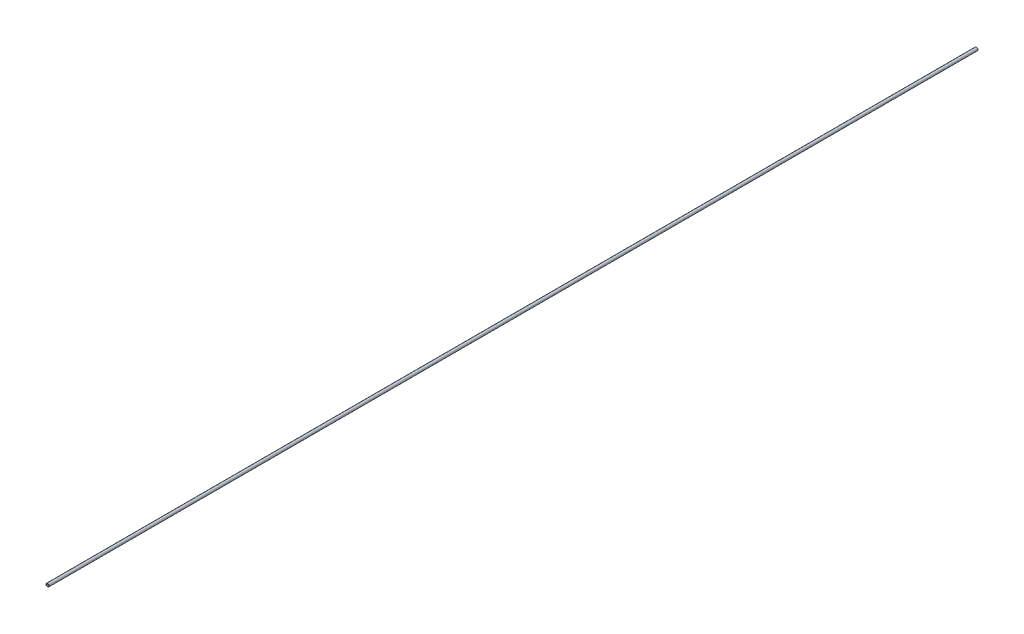
ISO-10303-21;
HEADER;
FILE_DESCRIPTION(('STEP AP214'),'2;1');
FILE_NAME('part.step','',(''),(''),'','','');
FILE_SCHEMA(('AUTOMOTIVE_DESIGN { 1 0 10303 214 1 1 1 1 }'));
ENDSEC;
DATA;
#1=APPLICATION_CONTEXT('core data for automotive mechanical design processes');
#2=APPLICATION_PROTOCOL_DEFINITION('international standard','automotive_design',2000,#1);
#3=PRODUCT_CONTEXT('',#1,'mechanical');
#4=PRODUCT('Part','Part','',(#3));
#5=PRODUCT_RELATED_PRODUCT_CATEGORY('part','',(#4));
#6=PRODUCT_DEFINITION_FORMATION('','',#4);
#7=PRODUCT_DEFINITION_CONTEXT('part definition',#1,'design');
#8=PRODUCT_DEFINITION('design','',#6,#7);
#9=PRODUCT_DEFINITION_SHAPE('','',#8);
#10=(LENGTH_UNIT() NAMED_UNIT(*) SI_UNIT(.MILLI.,.METRE.));
#11=(NAMED_UNIT(*) PLANE_ANGLE_UNIT() SI_UNIT($,.RADIAN.));
#12=(NAMED_UNIT(*) SI_UNIT($,.STERADIAN.) SOLID_ANGLE_UNIT());
#13=UNCERTAINTY_MEASURE_WITH_UNIT(LENGTH_MEASURE(1.E-05),#10,'distance_accuracy_value','');
#14=(GEOMETRIC_REPRESENTATION_CONTEXT(3) GLOBAL_UNCERTAINTY_ASSIGNED_CONTEXT((#13)) GLOBAL_UNIT_ASSIGNED_CONTEXT((#10,
#11,#12)) REPRESENTATION_CONTEXT('',''));
#15=CARTESIAN_POINT('',(0.,0.,0.));
#16=DIRECTION('',(0.,0.,1.));
#17=DIRECTION('',(1.,0.,0.));
#18=AXIS2_PLACEMENT_3D('',#15,#16,#17);
#19=CARTESIAN_POINT('',(0.,0.,0.));
#20=DIRECTION('',(0.,0.,1.));
#21=DIRECTION('',(1.,0.,0.));
#22=AXIS2_PLACEMENT_3D('',#19,#20,#21);
#23=PLANE('',#22);
#24=CARTESIAN_POINT('',(0.,0.,0.));
#25=DIRECTION('',(0.,0.,1.));
#26=DIRECTION('',(1.,0.,0.));
#27=AXIS2_PLACEMENT_3D('',#24,#25,#26);
#28=CIRCLE('',#27,2.5);
#29=CARTESIAN_POINT('',(2.5,0.,0.));
#30=VERTEX_POINT('',#29);
#31=EDGE_CURVE('E10',#30,#30,#28,.T.);
#32=ORIENTED_EDGE('',*,*,#31,.F.);
#33=EDGE_LOOP('',(#32));
#34=FACE_BOUND('',#33,.T.);
#35=CARTESIAN_POINT('',(0.,0.,0.));
#36=DIRECTION('',(0.,0.,1.));
#37=DIRECTION('',(1.,0.,0.));
#38=AXIS2_PLACEMENT_3D('',#35,#36,#37);
#39=CIRCLE('',#38,1.6);
#40=CARTESIAN_POINT('',(1.6,0.,0.));
#41=VERTEX_POINT('',#40);
#42=EDGE_CURVE('E38',#41,#41,#39,.T.);
#43=ORIENTED_EDGE('',*,*,#42,.T.);
#44=EDGE_LOOP('',(#43));
#45=FACE_BOUND('',#44,.T.);
#46=ADVANCED_FACE('F31',(#34,#45),#23,.F.);
#47=CARTESIAN_POINT('',(0.,0.,1000.));
#48=DIRECTION('',(0.,0.,-1.));
#49=DIRECTION('',(-1.,0.,0.));
#50=AXIS2_PLACEMENT_3D('',#47,#48,#49);
#51=CYLINDRICAL_SURFACE('',#50,2.5);
#52=ORIENTED_EDGE('',*,*,#31,.T.);
#53=EDGE_LOOP('',(#52));
#54=FACE_BOUND('',#53,.T.);
#55=CARTESIAN_POINT('',(0.,0.,1500.));
#56=DIRECTION('',(0.,0.,1.));
#57=DIRECTION('',(1.,0.,0.));
#58=AXIS2_PLACEMENT_3D('',#55,#56,#57);
#59=CIRCLE('',#58,2.5);
#60=CARTESIAN_POINT('',(2.5,0.,1500.));
#61=VERTEX_POINT('',#60);
#62=EDGE_CURVE('E42',#61,#61,#59,.T.);
#63=ORIENTED_EDGE('',*,*,#62,.F.);
#64=EDGE_LOOP('',(#63));
#65=FACE_BOUND('',#64,.T.);
#66=ADVANCED_FACE('F33',(#54,#65),#51,.T.);
#67=CARTESIAN_POINT('',(0.,0.,1000.));
#68=DIRECTION('',(0.,0.,-1.));
#69=DIRECTION('',(-1.,0.,0.));
#70=AXIS2_PLACEMENT_3D('',#67,#68,#69);
#71=CYLINDRICAL_SURFACE('',#70,1.6);
#72=ORIENTED_EDGE('',*,*,#42,.F.);
#73=EDGE_LOOP('',(#72));
#74=FACE_BOUND('',#73,.T.);
#75=CARTESIAN_POINT('',(0.,0.,1500.));
#76=DIRECTION('',(0.,0.,1.));
#77=DIRECTION('',(1.,0.,0.));
#78=AXIS2_PLACEMENT_3D('',#75,#76,#77);
#79=CIRCLE('',#78,1.6);
#80=CARTESIAN_POINT('',(1.6,0.,1500.));
#81=VERTEX_POINT('',#80);
#82=EDGE_CURVE('E46',#81,#81,#79,.T.);
#83=ORIENTED_EDGE('',*,*,#82,.T.);
#84=EDGE_LOOP('',(#83));
#85=FACE_BOUND('',#84,.T.);
#86=ADVANCED_FACE('F52',(#74,#85),#71,.F.);
#87=CARTESIAN_POINT('',(0.,0.,1500.));
#88=DIRECTION('',(0.,0.,1.));
#89=DIRECTION('',(1.,0.,0.));
#90=AXIS2_PLACEMENT_3D('',#87,#88,#89);
#91=PLANE('',#90);
#92=ORIENTED_EDGE('',*,*,#62,.T.);
#93=EDGE_LOOP('',(#92));
#94=FACE_BOUND('',#93,.T.);
#95=ORIENTED_EDGE('',*,*,#82,.F.);
#96=EDGE_LOOP('',(#95));
#97=FACE_BOUND('',#96,.T.);
#98=ADVANCED_FACE('F54',(#94,#97),#91,.T.);
#99=CLOSED_SHELL('',(#46,#66,#86,#98));
#100=MANIFOLD_SOLID_BREP('B2',#99);
#101=ADVANCED_BREP_SHAPE_REPRESENTATION('',(#18,#100),#14);
#102=SHAPE_DEFINITION_REPRESENTATION(#9,#101);
ENDSEC;
END-ISO-10303-21;
